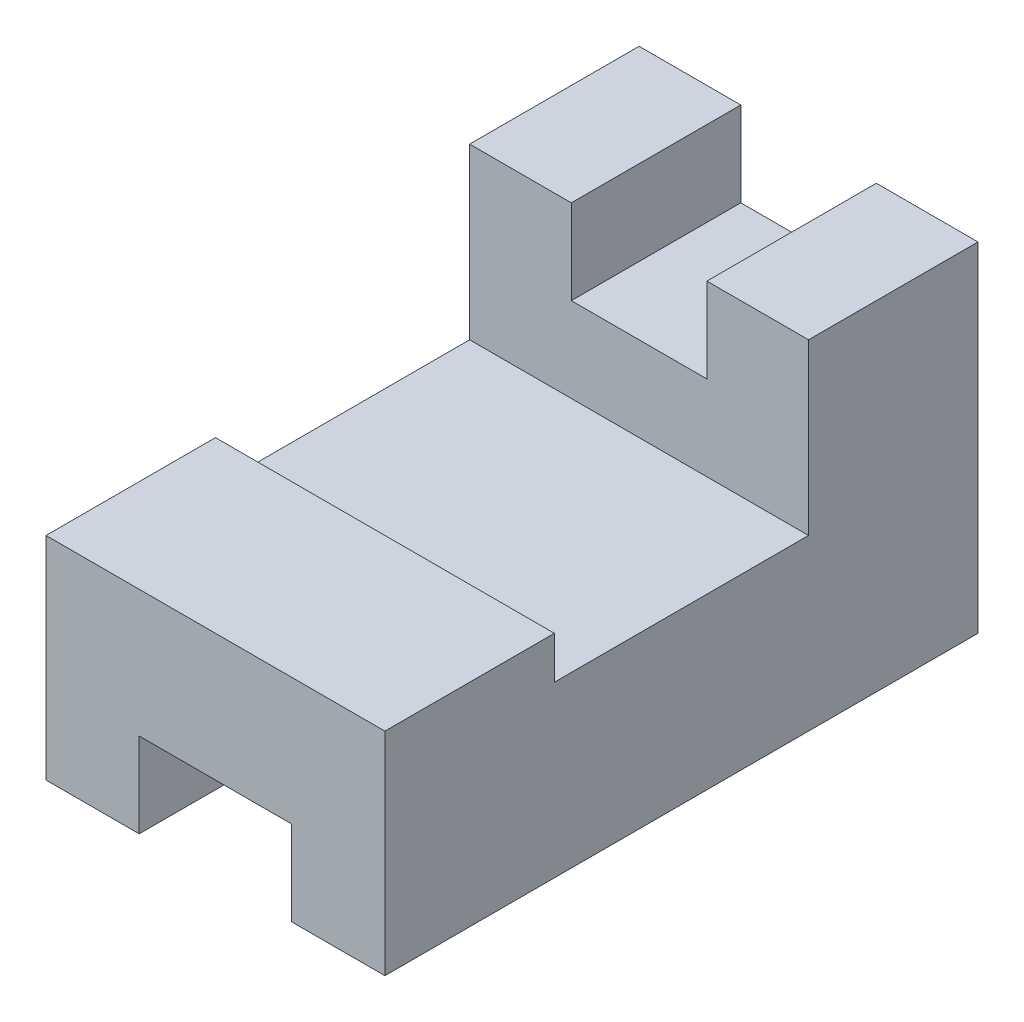
ISO-10303-21;
HEADER;
FILE_DESCRIPTION(('STEP AP214'),'2;1');
FILE_NAME('part.step','',(''),(''),'','','');
FILE_SCHEMA(('AUTOMOTIVE_DESIGN { 1 0 10303 214 1 1 1 1 }'));
ENDSEC;
DATA;
#1=APPLICATION_CONTEXT('core data for automotive mechanical design processes');
#2=APPLICATION_PROTOCOL_DEFINITION('international standard','automotive_design',2000,#1);
#3=PRODUCT_CONTEXT('',#1,'mechanical');
#4=PRODUCT('Part','Part','',(#3));
#5=PRODUCT_RELATED_PRODUCT_CATEGORY('part','',(#4));
#6=PRODUCT_DEFINITION_FORMATION('','',#4);
#7=PRODUCT_DEFINITION_CONTEXT('part definition',#1,'design');
#8=PRODUCT_DEFINITION('design','',#6,#7);
#9=PRODUCT_DEFINITION_SHAPE('','',#8);
#10=(LENGTH_UNIT() NAMED_UNIT(*) SI_UNIT(.MILLI.,.METRE.));
#11=(NAMED_UNIT(*) PLANE_ANGLE_UNIT() SI_UNIT($,.RADIAN.));
#12=(NAMED_UNIT(*) SI_UNIT($,.STERADIAN.) SOLID_ANGLE_UNIT());
#13=UNCERTAINTY_MEASURE_WITH_UNIT(LENGTH_MEASURE(1.E-05),#10,'distance_accuracy_value','');
#14=(GEOMETRIC_REPRESENTATION_CONTEXT(3) GLOBAL_UNCERTAINTY_ASSIGNED_CONTEXT((#13)) GLOBAL_UNIT_ASSIGNED_CONTEXT((#10,
#11,#12)) REPRESENTATION_CONTEXT('',''));
#15=CARTESIAN_POINT('',(0.,0.,0.));
#16=DIRECTION('',(0.,0.,1.));
#17=DIRECTION('',(1.,0.,0.));
#18=AXIS2_PLACEMENT_3D('',#15,#16,#17);
#19=CARTESIAN_POINT('',(0.,40.,0.));
#20=DIRECTION('',(0.,1.,0.));
#21=DIRECTION('',(0.,0.,1.));
#22=AXIS2_PLACEMENT_3D('',#19,#20,#21);
#23=PLANE('',#22);
#24=DIRECTION('',(0.,0.,1.));
#25=VECTOR('',#24,1.);
#26=CARTESIAN_POINT('',(-8.,40.,-35.));
#27=LINE('',#26,#25);
#28=CARTESIAN_POINT('',(-8.,40.,-35.));
#29=VERTEX_POINT('',#28);
#30=CARTESIAN_POINT('',(-8.,40.,-15.));
#31=VERTEX_POINT('',#30);
#32=EDGE_CURVE('E177',#29,#31,#27,.T.);
#33=ORIENTED_EDGE('',*,*,#32,.F.);
#34=DIRECTION('',(-1.,0.,0.));
#35=VECTOR('',#34,1.);
#36=CARTESIAN_POINT('',(-20.,40.,-35.));
#37=LINE('',#36,#35);
#38=CARTESIAN_POINT('',(-20.,40.,-35.));
#39=VERTEX_POINT('',#38);
#40=EDGE_CURVE('E169',#29,#39,#37,.T.);
#41=ORIENTED_EDGE('',*,*,#40,.T.);
#42=DIRECTION('',(0.,0.,1.));
#43=VECTOR('',#42,1.);
#44=CARTESIAN_POINT('',(-20.,40.,-35.));
#45=LINE('',#44,#43);
#46=CARTESIAN_POINT('',(-20.,40.,-15.));
#47=VERTEX_POINT('',#46);
#48=EDGE_CURVE('E182',#39,#47,#45,.T.);
#49=ORIENTED_EDGE('',*,*,#48,.T.);
#50=DIRECTION('',(1.,0.,0.));
#51=VECTOR('',#50,1.);
#52=CARTESIAN_POINT('',(-20.,40.,-15.));
#53=LINE('',#52,#51);
#54=EDGE_CURVE('E186',#47,#31,#53,.T.);
#55=ORIENTED_EDGE('',*,*,#54,.T.);
#56=EDGE_LOOP('',(#33,#41,#49,#55));
#57=FACE_BOUND('',#56,.T.);
#58=ADVANCED_FACE('F33',(#57),#23,.T.);
#59=CARTESIAN_POINT('',(0.,20.,0.));
#60=DIRECTION('',(0.,1.,0.));
#61=DIRECTION('',(0.,0.,1.));
#62=AXIS2_PLACEMENT_3D('',#59,#60,#61);
#63=PLANE('',#62);
#64=DIRECTION('',(0.,0.,-1.));
#65=VECTOR('',#64,1.);
#66=CARTESIAN_POINT('',(20.,20.,-35.));
#67=LINE('',#66,#65);
#68=CARTESIAN_POINT('',(20.,20.,15.));
#69=VERTEX_POINT('',#68);
#70=CARTESIAN_POINT('',(20.,20.,-15.));
#71=VERTEX_POINT('',#70);
#72=EDGE_CURVE('E248',#69,#71,#67,.T.);
#73=ORIENTED_EDGE('',*,*,#72,.T.);
#74=DIRECTION('',(1.,0.,0.));
#75=VECTOR('',#74,1.);
#76=CARTESIAN_POINT('',(-20.,20.,-15.));
#77=LINE('',#76,#75);
#78=CARTESIAN_POINT('',(-20.,20.,-15.));
#79=VERTEX_POINT('',#78);
#80=EDGE_CURVE('E56',#79,#71,#77,.T.);
#81=ORIENTED_EDGE('',*,*,#80,.F.);
#82=DIRECTION('',(0.,0.,1.));
#83=VECTOR('',#82,1.);
#84=CARTESIAN_POINT('',(-20.,20.,-35.));
#85=LINE('',#84,#83);
#86=CARTESIAN_POINT('',(-20.,20.,15.));
#87=VERTEX_POINT('',#86);
#88=EDGE_CURVE('E250',#79,#87,#85,.T.);
#89=ORIENTED_EDGE('',*,*,#88,.T.);
#90=DIRECTION('',(-1.,0.,0.));
#91=VECTOR('',#90,1.);
#92=CARTESIAN_POINT('',(-20.,20.,15.));
#93=LINE('',#92,#91);
#94=EDGE_CURVE('E202',#69,#87,#93,.T.);
#95=ORIENTED_EDGE('',*,*,#94,.F.);
#96=EDGE_LOOP('',(#73,#81,#89,#95));
#97=FACE_BOUND('',#96,.T.);
#98=ADVANCED_FACE('F294',(#97),#63,.T.);
#99=CARTESIAN_POINT('',(0.,0.,0.));
#100=DIRECTION('',(0.,1.,0.));
#101=DIRECTION('',(0.,0.,1.));
#102=AXIS2_PLACEMENT_3D('',#99,#100,#101);
#103=PLANE('',#102);
#104=DIRECTION('',(-1.,0.,0.));
#105=VECTOR('',#104,1.);
#106=CARTESIAN_POINT('',(-20.,0.,-35.));
#107=LINE('',#106,#105);
#108=CARTESIAN_POINT('',(-9.,0.,-35.));
#109=VERTEX_POINT('',#108);
#110=CARTESIAN_POINT('',(-20.,0.,-35.));
#111=VERTEX_POINT('',#110);
#112=EDGE_CURVE('E256',#109,#111,#107,.T.);
#113=ORIENTED_EDGE('',*,*,#112,.F.);
#114=DIRECTION('',(0.,0.,1.));
#115=VECTOR('',#114,1.);
#116=CARTESIAN_POINT('',(-9.,0.,-35.));
#117=LINE('',#116,#115);
#118=CARTESIAN_POINT('',(-9.,0.,35.));
#119=VERTEX_POINT('',#118);
#120=EDGE_CURVE('E232',#109,#119,#117,.T.);
#121=ORIENTED_EDGE('',*,*,#120,.T.);
#122=DIRECTION('',(1.,0.,0.));
#123=VECTOR('',#122,1.);
#124=CARTESIAN_POINT('',(-20.,0.,35.));
#125=LINE('',#124,#123);
#126=CARTESIAN_POINT('',(-20.,0.,35.));
#127=VERTEX_POINT('',#126);
#128=EDGE_CURVE('E251',#127,#119,#125,.T.);
#129=ORIENTED_EDGE('',*,*,#128,.F.);
#130=DIRECTION('',(0.,0.,1.));
#131=VECTOR('',#130,1.);
#132=CARTESIAN_POINT('',(-20.,0.,-35.));
#133=LINE('',#132,#131);
#134=EDGE_CURVE('E260',#111,#127,#133,.T.);
#135=ORIENTED_EDGE('',*,*,#134,.F.);
#136=EDGE_LOOP('',(#113,#121,#129,#135));
#137=FACE_BOUND('',#136,.T.);
#138=ADVANCED_FACE('F278',(#137),#103,.F.);
#139=CARTESIAN_POINT('',(20.,20.,-35.));
#140=DIRECTION('',(-1.,0.,0.));
#141=DIRECTION('',(0.,0.,1.));
#142=AXIS2_PLACEMENT_3D('',#139,#140,#141);
#143=PLANE('',#142);
#144=DIRECTION('',(0.,0.,-1.));
#145=VECTOR('',#144,1.);
#146=CARTESIAN_POINT('',(20.,0.,-35.));
#147=LINE('',#146,#145);
#148=CARTESIAN_POINT('',(20.,0.,35.));
#149=VERTEX_POINT('',#148);
#150=CARTESIAN_POINT('',(20.,0.,-35.));
#151=VERTEX_POINT('',#150);
#152=EDGE_CURVE('E241',#149,#151,#147,.T.);
#153=ORIENTED_EDGE('',*,*,#152,.T.);
#154=DIRECTION('',(0.,-1.,0.));
#155=VECTOR('',#154,1.);
#156=CARTESIAN_POINT('',(20.,20.,-35.));
#157=LINE('',#156,#155);
#158=CARTESIAN_POINT('',(20.,40.,-35.));
#159=VERTEX_POINT('',#158);
#160=EDGE_CURVE('E11',#159,#151,#157,.T.);
#161=ORIENTED_EDGE('',*,*,#160,.F.);
#162=DIRECTION('',(0.,0.,-1.));
#163=VECTOR('',#162,1.);
#164=CARTESIAN_POINT('',(20.,40.,-35.));
#165=LINE('',#164,#163);
#166=CARTESIAN_POINT('',(20.,40.,-15.));
#167=VERTEX_POINT('',#166);
#168=EDGE_CURVE('E189',#167,#159,#165,.T.);
#169=ORIENTED_EDGE('',*,*,#168,.F.);
#170=DIRECTION('',(0.,-1.,0.));
#171=VECTOR('',#170,1.);
#172=CARTESIAN_POINT('',(20.,40.,-15.));
#173=LINE('',#172,#171);
#174=EDGE_CURVE('E195',#167,#71,#173,.T.);
#175=ORIENTED_EDGE('',*,*,#174,.T.);
#176=ORIENTED_EDGE('',*,*,#72,.F.);
#177=DIRECTION('',(0.,-1.,0.));
#178=VECTOR('',#177,1.);
#179=CARTESIAN_POINT('',(20.,25.,15.));
#180=LINE('',#179,#178);
#181=CARTESIAN_POINT('',(20.,25.,15.));
#182=VERTEX_POINT('',#181);
#183=EDGE_CURVE('E218',#182,#69,#180,.T.);
#184=ORIENTED_EDGE('',*,*,#183,.F.);
#185=DIRECTION('',(0.,0.,-1.));
#186=VECTOR('',#185,1.);
#187=CARTESIAN_POINT('',(20.,25.,35.));
#188=LINE('',#187,#186);
#189=CARTESIAN_POINT('',(20.,25.,35.));
#190=VERTEX_POINT('',#189);
#191=EDGE_CURVE('E209',#190,#182,#188,.T.);
#192=ORIENTED_EDGE('',*,*,#191,.F.);
#193=DIRECTION('',(0.,-1.,0.));
#194=VECTOR('',#193,1.);
#195=CARTESIAN_POINT('',(20.,20.,35.));
#196=LINE('',#195,#194);
#197=EDGE_CURVE('E253',#190,#149,#196,.T.);
#198=ORIENTED_EDGE('',*,*,#197,.T.);
#199=EDGE_LOOP('',(#153,#161,#169,#175,#176,#184,#192,#198));
#200=FACE_BOUND('',#199,.T.);
#201=ADVANCED_FACE('F35',(#200),#143,.F.);
#202=CARTESIAN_POINT('',(-20.,20.,-35.));
#203=DIRECTION('',(0.,0.,1.));
#204=DIRECTION('',(1.,0.,0.));
#205=AXIS2_PLACEMENT_3D('',#202,#203,#204);
#206=PLANE('',#205);
#207=ORIENTED_EDGE('',*,*,#40,.F.);
#208=DIRECTION('',(0.,-1.,0.));
#209=VECTOR('',#208,1.);
#210=CARTESIAN_POINT('',(-8.,40.,-35.));
#211=LINE('',#210,#209);
#212=CARTESIAN_POINT('',(-8.,30.,-35.));
#213=VERTEX_POINT('',#212);
#214=EDGE_CURVE('E149',#29,#213,#211,.T.);
#215=ORIENTED_EDGE('',*,*,#214,.T.);
#216=DIRECTION('',(1.,0.,0.));
#217=VECTOR('',#216,1.);
#218=CARTESIAN_POINT('',(-8.,30.,-35.));
#219=LINE('',#218,#217);
#220=CARTESIAN_POINT('',(8.,30.,-35.));
#221=VERTEX_POINT('',#220);
#222=EDGE_CURVE('E160',#213,#221,#219,.T.);
#223=ORIENTED_EDGE('',*,*,#222,.T.);
#224=DIRECTION('',(0.,1.,0.));
#225=VECTOR('',#224,1.);
#226=CARTESIAN_POINT('',(8.,40.,-35.));
#227=LINE('',#226,#225);
#228=CARTESIAN_POINT('',(8.,40.,-35.));
#229=VERTEX_POINT('',#228);
#230=EDGE_CURVE('E157',#221,#229,#227,.T.);
#231=ORIENTED_EDGE('',*,*,#230,.T.);
#232=EDGE_CURVE('E192',#159,#229,#37,.T.);
#233=ORIENTED_EDGE('',*,*,#232,.F.);
#234=ORIENTED_EDGE('',*,*,#160,.T.);
#235=CARTESIAN_POINT('',(9.,0.,-35.));
#236=VERTEX_POINT('',#235);
#237=EDGE_CURVE('E257',#151,#236,#107,.T.);
#238=ORIENTED_EDGE('',*,*,#237,.T.);
#239=DIRECTION('',(0.,1.,0.));
#240=VECTOR('',#239,1.);
#241=CARTESIAN_POINT('',(9.,0.,-35.));
#242=LINE('',#241,#240);
#243=CARTESIAN_POINT('',(9.,10.,-35.));
#244=VERTEX_POINT('',#243);
#245=EDGE_CURVE('E225',#236,#244,#242,.T.);
#246=ORIENTED_EDGE('',*,*,#245,.T.);
#247=DIRECTION('',(-1.,0.,0.));
#248=VECTOR('',#247,1.);
#249=CARTESIAN_POINT('',(-9.,10.,-35.));
#250=LINE('',#249,#248);
#251=CARTESIAN_POINT('',(-9.,10.,-35.));
#252=VERTEX_POINT('',#251);
#253=EDGE_CURVE('E229',#244,#252,#250,.T.);
#254=ORIENTED_EDGE('',*,*,#253,.T.);
#255=DIRECTION('',(0.,-1.,0.));
#256=VECTOR('',#255,1.);
#257=CARTESIAN_POINT('',(-9.,0.,-35.));
#258=LINE('',#257,#256);
#259=EDGE_CURVE('E222',#252,#109,#258,.T.);
#260=ORIENTED_EDGE('',*,*,#259,.T.);
#261=ORIENTED_EDGE('',*,*,#112,.T.);
#262=DIRECTION('',(0.,-1.,0.));
#263=VECTOR('',#262,1.);
#264=CARTESIAN_POINT('',(-20.,20.,-35.));
#265=LINE('',#264,#263);
#266=EDGE_CURVE('E41',#39,#111,#265,.T.);
#267=ORIENTED_EDGE('',*,*,#266,.F.);
#268=EDGE_LOOP('',(#207,#215,#223,#231,#233,#234,#238,#246,#254,#260,#261,#267));
#269=FACE_BOUND('',#268,.T.);
#270=ADVANCED_FACE('F167',(#269),#206,.F.);
#271=CARTESIAN_POINT('',(-20.,20.,-35.));
#272=DIRECTION('',(1.,0.,0.));
#273=DIRECTION('',(0.,0.,-1.));
#274=AXIS2_PLACEMENT_3D('',#271,#272,#273);
#275=PLANE('',#274);
#276=ORIENTED_EDGE('',*,*,#134,.T.);
#277=DIRECTION('',(0.,-1.,0.));
#278=VECTOR('',#277,1.);
#279=CARTESIAN_POINT('',(-20.,20.,35.));
#280=LINE('',#279,#278);
#281=CARTESIAN_POINT('',(-20.,25.,35.));
#282=VERTEX_POINT('',#281);
#283=EDGE_CURVE('E267',#282,#127,#280,.T.);
#284=ORIENTED_EDGE('',*,*,#283,.F.);
#285=DIRECTION('',(0.,0.,1.));
#286=VECTOR('',#285,1.);
#287=CARTESIAN_POINT('',(-20.,25.,35.));
#288=LINE('',#287,#286);
#289=CARTESIAN_POINT('',(-20.,25.,15.));
#290=VERTEX_POINT('',#289);
#291=EDGE_CURVE('E203',#290,#282,#288,.T.);
#292=ORIENTED_EDGE('',*,*,#291,.F.);
#293=DIRECTION('',(0.,-1.,0.));
#294=VECTOR('',#293,1.);
#295=CARTESIAN_POINT('',(-20.,25.,15.));
#296=LINE('',#295,#294);
#297=EDGE_CURVE('E213',#290,#87,#296,.T.);
#298=ORIENTED_EDGE('',*,*,#297,.T.);
#299=ORIENTED_EDGE('',*,*,#88,.F.);
#300=DIRECTION('',(0.,-1.,0.));
#301=VECTOR('',#300,1.);
#302=CARTESIAN_POINT('',(-20.,40.,-15.));
#303=LINE('',#302,#301);
#304=EDGE_CURVE('E199',#47,#79,#303,.T.);
#305=ORIENTED_EDGE('',*,*,#304,.F.);
#306=ORIENTED_EDGE('',*,*,#48,.F.);
#307=ORIENTED_EDGE('',*,*,#266,.T.);
#308=EDGE_LOOP('',(#276,#284,#292,#298,#299,#305,#306,#307));
#309=FACE_BOUND('',#308,.T.);
#310=ADVANCED_FACE('F273',(#309),#275,.F.);
#311=CARTESIAN_POINT('',(-20.,20.,35.));
#312=DIRECTION('',(0.,0.,-1.));
#313=DIRECTION('',(-1.,0.,0.));
#314=AXIS2_PLACEMENT_3D('',#311,#312,#313);
#315=PLANE('',#314);
#316=ORIENTED_EDGE('',*,*,#128,.T.);
#317=DIRECTION('',(0.,-1.,0.));
#318=VECTOR('',#317,1.);
#319=CARTESIAN_POINT('',(-9.,0.,35.));
#320=LINE('',#319,#318);
#321=CARTESIAN_POINT('',(-9.,10.,35.));
#322=VERTEX_POINT('',#321);
#323=EDGE_CURVE('E221',#322,#119,#320,.T.);
#324=ORIENTED_EDGE('',*,*,#323,.F.);
#325=DIRECTION('',(-1.,0.,0.));
#326=VECTOR('',#325,1.);
#327=CARTESIAN_POINT('',(-9.,10.,35.));
#328=LINE('',#327,#326);
#329=CARTESIAN_POINT('',(9.,10.,35.));
#330=VERTEX_POINT('',#329);
#331=EDGE_CURVE('E226',#330,#322,#328,.T.);
#332=ORIENTED_EDGE('',*,*,#331,.F.);
#333=DIRECTION('',(0.,1.,0.));
#334=VECTOR('',#333,1.);
#335=CARTESIAN_POINT('',(9.,0.,35.));
#336=LINE('',#335,#334);
#337=CARTESIAN_POINT('',(9.,0.,35.));
#338=VERTEX_POINT('',#337);
#339=EDGE_CURVE('E234',#338,#330,#336,.T.);
#340=ORIENTED_EDGE('',*,*,#339,.F.);
#341=EDGE_CURVE('E262',#338,#149,#125,.T.);
#342=ORIENTED_EDGE('',*,*,#341,.T.);
#343=ORIENTED_EDGE('',*,*,#197,.F.);
#344=DIRECTION('',(1.,0.,0.));
#345=VECTOR('',#344,1.);
#346=CARTESIAN_POINT('',(-20.,25.,35.));
#347=LINE('',#346,#345);
#348=EDGE_CURVE('E206',#282,#190,#347,.T.);
#349=ORIENTED_EDGE('',*,*,#348,.F.);
#350=ORIENTED_EDGE('',*,*,#283,.T.);
#351=EDGE_LOOP('',(#316,#324,#332,#340,#342,#343,#349,#350));
#352=FACE_BOUND('',#351,.T.);
#353=ADVANCED_FACE('F281',(#352),#315,.F.);
#354=ORIENTED_EDGE('',*,*,#341,.F.);
#355=DIRECTION('',(0.,0.,1.));
#356=VECTOR('',#355,1.);
#357=CARTESIAN_POINT('',(9.,0.,-35.));
#358=LINE('',#357,#356);
#359=EDGE_CURVE('E244',#236,#338,#358,.T.);
#360=ORIENTED_EDGE('',*,*,#359,.F.);
#361=ORIENTED_EDGE('',*,*,#237,.F.);
#362=ORIENTED_EDGE('',*,*,#152,.F.);
#363=EDGE_LOOP('',(#354,#360,#361,#362));
#364=FACE_BOUND('',#363,.T.);
#365=ADVANCED_FACE('F322',(#364),#103,.F.);
#366=CARTESIAN_POINT('',(-9.,0.,-35.));
#367=DIRECTION('',(-1.,0.,0.));
#368=DIRECTION('',(0.,0.,1.));
#369=AXIS2_PLACEMENT_3D('',#366,#367,#368);
#370=PLANE('',#369);
#371=ORIENTED_EDGE('',*,*,#323,.T.);
#372=ORIENTED_EDGE('',*,*,#120,.F.);
#373=ORIENTED_EDGE('',*,*,#259,.F.);
#374=DIRECTION('',(0.,0.,1.));
#375=VECTOR('',#374,1.);
#376=CARTESIAN_POINT('',(-9.,10.,-35.));
#377=LINE('',#376,#375);
#378=EDGE_CURVE('E239',#252,#322,#377,.T.);
#379=ORIENTED_EDGE('',*,*,#378,.T.);
#380=EDGE_LOOP('',(#371,#372,#373,#379));
#381=FACE_BOUND('',#380,.T.);
#382=ADVANCED_FACE('F332',(#381),#370,.F.);
#383=CARTESIAN_POINT('',(-9.,10.,-35.));
#384=DIRECTION('',(0.,1.,0.));
#385=DIRECTION('',(0.,0.,1.));
#386=AXIS2_PLACEMENT_3D('',#383,#384,#385);
#387=PLANE('',#386);
#388=ORIENTED_EDGE('',*,*,#331,.T.);
#389=ORIENTED_EDGE('',*,*,#378,.F.);
#390=ORIENTED_EDGE('',*,*,#253,.F.);
#391=DIRECTION('',(0.,0.,1.));
#392=VECTOR('',#391,1.);
#393=CARTESIAN_POINT('',(9.,10.,-35.));
#394=LINE('',#393,#392);
#395=EDGE_CURVE('E242',#244,#330,#394,.T.);
#396=ORIENTED_EDGE('',*,*,#395,.T.);
#397=EDGE_LOOP('',(#388,#389,#390,#396));
#398=FACE_BOUND('',#397,.T.);
#399=ADVANCED_FACE('F328',(#398),#387,.F.);
#400=CARTESIAN_POINT('',(9.,0.,-35.));
#401=DIRECTION('',(1.,0.,0.));
#402=DIRECTION('',(0.,0.,-1.));
#403=AXIS2_PLACEMENT_3D('',#400,#401,#402);
#404=PLANE('',#403);
#405=ORIENTED_EDGE('',*,*,#339,.T.);
#406=ORIENTED_EDGE('',*,*,#395,.F.);
#407=ORIENTED_EDGE('',*,*,#245,.F.);
#408=ORIENTED_EDGE('',*,*,#359,.T.);
#409=EDGE_LOOP('',(#405,#406,#407,#408));
#410=FACE_BOUND('',#409,.T.);
#411=ADVANCED_FACE('F326',(#410),#404,.F.);
#412=CARTESIAN_POINT('',(-20.,25.,15.));
#413=DIRECTION('',(0.,0.,1.));
#414=DIRECTION('',(1.,0.,0.));
#415=AXIS2_PLACEMENT_3D('',#412,#413,#414);
#416=PLANE('',#415);
#417=ORIENTED_EDGE('',*,*,#94,.T.);
#418=ORIENTED_EDGE('',*,*,#297,.F.);
#419=DIRECTION('',(-1.,0.,0.));
#420=VECTOR('',#419,1.);
#421=CARTESIAN_POINT('',(-20.,25.,15.));
#422=LINE('',#421,#420);
#423=EDGE_CURVE('E211',#182,#290,#422,.T.);
#424=ORIENTED_EDGE('',*,*,#423,.F.);
#425=ORIENTED_EDGE('',*,*,#183,.T.);
#426=EDGE_LOOP('',(#417,#418,#424,#425));
#427=FACE_BOUND('',#426,.T.);
#428=ADVANCED_FACE('F292',(#427),#416,.F.);
#429=CARTESIAN_POINT('',(0.,25.,0.));
#430=DIRECTION('',(0.,-1.,0.));
#431=DIRECTION('',(0.,0.,-1.));
#432=AXIS2_PLACEMENT_3D('',#429,#430,#431);
#433=PLANE('',#432);
#434=ORIENTED_EDGE('',*,*,#291,.T.);
#435=ORIENTED_EDGE('',*,*,#348,.T.);
#436=ORIENTED_EDGE('',*,*,#191,.T.);
#437=ORIENTED_EDGE('',*,*,#423,.T.);
#438=EDGE_LOOP('',(#434,#435,#436,#437));
#439=FACE_BOUND('',#438,.T.);
#440=ADVANCED_FACE('F287',(#439),#433,.F.);
#441=CARTESIAN_POINT('',(-20.,40.,-15.));
#442=DIRECTION('',(0.,0.,-1.));
#443=DIRECTION('',(-1.,0.,0.));
#444=AXIS2_PLACEMENT_3D('',#441,#442,#443);
#445=PLANE('',#444);
#446=DIRECTION('',(1.,0.,0.));
#447=VECTOR('',#446,1.);
#448=CARTESIAN_POINT('',(-8.,30.,-15.));
#449=LINE('',#448,#447);
#450=CARTESIAN_POINT('',(-8.,30.,-15.));
#451=VERTEX_POINT('',#450);
#452=CARTESIAN_POINT('',(8.,30.,-15.));
#453=VERTEX_POINT('',#452);
#454=EDGE_CURVE('E171',#451,#453,#449,.T.);
#455=ORIENTED_EDGE('',*,*,#454,.F.);
#456=DIRECTION('',(0.,-1.,0.));
#457=VECTOR('',#456,1.);
#458=CARTESIAN_POINT('',(-8.,40.,-15.));
#459=LINE('',#458,#457);
#460=EDGE_CURVE('E152',#31,#451,#459,.T.);
#461=ORIENTED_EDGE('',*,*,#460,.F.);
#462=ORIENTED_EDGE('',*,*,#54,.F.);
#463=ORIENTED_EDGE('',*,*,#304,.T.);
#464=ORIENTED_EDGE('',*,*,#80,.T.);
#465=ORIENTED_EDGE('',*,*,#174,.F.);
#466=CARTESIAN_POINT('',(8.,40.,-15.));
#467=VERTEX_POINT('',#466);
#468=EDGE_CURVE('E185',#467,#167,#53,.T.);
#469=ORIENTED_EDGE('',*,*,#468,.F.);
#470=DIRECTION('',(0.,1.,0.));
#471=VECTOR('',#470,1.);
#472=CARTESIAN_POINT('',(8.,40.,-15.));
#473=LINE('',#472,#471);
#474=EDGE_CURVE('E48',#453,#467,#473,.T.);
#475=ORIENTED_EDGE('',*,*,#474,.F.);
#476=EDGE_LOOP('',(#455,#461,#462,#463,#464,#465,#469,#475));
#477=FACE_BOUND('',#476,.T.);
#478=ADVANCED_FACE('F300',(#477),#445,.F.);
#479=DIRECTION('',(0.,0.,1.));
#480=VECTOR('',#479,1.);
#481=CARTESIAN_POINT('',(8.,40.,-35.));
#482=LINE('',#481,#480);
#483=EDGE_CURVE('E179',#229,#467,#482,.T.);
#484=ORIENTED_EDGE('',*,*,#483,.T.);
#485=ORIENTED_EDGE('',*,*,#468,.T.);
#486=ORIENTED_EDGE('',*,*,#168,.T.);
#487=ORIENTED_EDGE('',*,*,#232,.T.);
#488=EDGE_LOOP('',(#484,#485,#486,#487));
#489=FACE_BOUND('',#488,.T.);
#490=ADVANCED_FACE('F304',(#489),#23,.T.);
#491=CARTESIAN_POINT('',(-8.,40.,-35.));
#492=DIRECTION('',(-1.,0.,0.));
#493=DIRECTION('',(0.,0.,1.));
#494=AXIS2_PLACEMENT_3D('',#491,#492,#493);
#495=PLANE('',#494);
#496=ORIENTED_EDGE('',*,*,#460,.T.);
#497=DIRECTION('',(0.,0.,1.));
#498=VECTOR('',#497,1.);
#499=CARTESIAN_POINT('',(-8.,30.,-35.));
#500=LINE('',#499,#498);
#501=EDGE_CURVE('E145',#213,#451,#500,.T.);
#502=ORIENTED_EDGE('',*,*,#501,.F.);
#503=ORIENTED_EDGE('',*,*,#214,.F.);
#504=ORIENTED_EDGE('',*,*,#32,.T.);
#505=EDGE_LOOP('',(#496,#502,#503,#504));
#506=FACE_BOUND('',#505,.T.);
#507=ADVANCED_FACE('F147',(#506),#495,.F.);
#508=CARTESIAN_POINT('',(8.,40.,-35.));
#509=DIRECTION('',(1.,0.,0.));
#510=DIRECTION('',(0.,1.,0.));
#511=AXIS2_PLACEMENT_3D('',#508,#509,#510);
#512=PLANE('',#511);
#513=ORIENTED_EDGE('',*,*,#474,.T.);
#514=ORIENTED_EDGE('',*,*,#483,.F.);
#515=ORIENTED_EDGE('',*,*,#230,.F.);
#516=DIRECTION('',(0.,0.,1.));
#517=VECTOR('',#516,1.);
#518=CARTESIAN_POINT('',(8.,30.,-35.));
#519=LINE('',#518,#517);
#520=EDGE_CURVE('E156',#221,#453,#519,.T.);
#521=ORIENTED_EDGE('',*,*,#520,.T.);
#522=EDGE_LOOP('',(#513,#514,#515,#521));
#523=FACE_BOUND('',#522,.T.);
#524=ADVANCED_FACE('F317',(#523),#512,.F.);
#525=CARTESIAN_POINT('',(-8.,30.,-35.));
#526=DIRECTION('',(0.,-1.,0.));
#527=DIRECTION('',(0.,0.,-1.));
#528=AXIS2_PLACEMENT_3D('',#525,#526,#527);
#529=PLANE('',#528);
#530=ORIENTED_EDGE('',*,*,#454,.T.);
#531=ORIENTED_EDGE('',*,*,#520,.F.);
#532=ORIENTED_EDGE('',*,*,#222,.F.);
#533=ORIENTED_EDGE('',*,*,#501,.T.);
#534=EDGE_LOOP('',(#530,#531,#532,#533));
#535=FACE_BOUND('',#534,.T.);
#536=ADVANCED_FACE('F161',(#535),#529,.F.);
#537=CLOSED_SHELL('',(#58,#98,#138,#201,#270,#310,#353,#365,#382,#399,#411,#428,#440,#478,#490,
#507,#524,#536));
#538=MANIFOLD_SOLID_BREP('B2',#537);
#539=ADVANCED_BREP_SHAPE_REPRESENTATION('',(#18,#538),#14);
#540=SHAPE_DEFINITION_REPRESENTATION(#9,#539);
ENDSEC;
END-ISO-10303-21;
